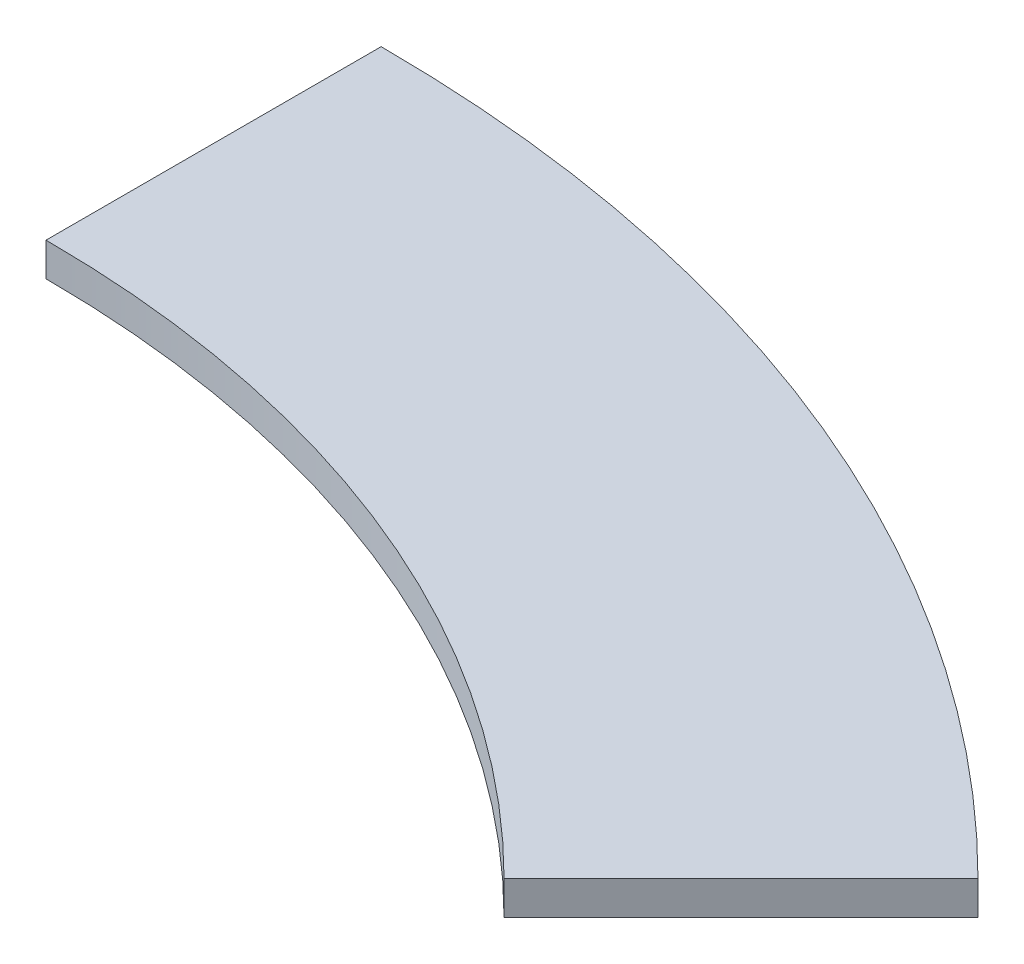
ISO-10303-21;
HEADER;
FILE_DESCRIPTION(('STEP AP214'),'2;1');
FILE_NAME('part.step','',(''),(''),'','','');
FILE_SCHEMA(('AUTOMOTIVE_DESIGN { 1 0 10303 214 1 1 1 1 }'));
ENDSEC;
DATA;
#1=APPLICATION_CONTEXT('core data for automotive mechanical design processes');
#2=APPLICATION_PROTOCOL_DEFINITION('international standard','automotive_design',2000,#1);
#3=PRODUCT_CONTEXT('',#1,'mechanical');
#4=PRODUCT('Part','Part','',(#3));
#5=PRODUCT_RELATED_PRODUCT_CATEGORY('part','',(#4));
#6=PRODUCT_DEFINITION_FORMATION('','',#4);
#7=PRODUCT_DEFINITION_CONTEXT('part definition',#1,'design');
#8=PRODUCT_DEFINITION('design','',#6,#7);
#9=PRODUCT_DEFINITION_SHAPE('','',#8);
#10=(LENGTH_UNIT() NAMED_UNIT(*) SI_UNIT(.MILLI.,.METRE.));
#11=(NAMED_UNIT(*) PLANE_ANGLE_UNIT() SI_UNIT($,.RADIAN.));
#12=(NAMED_UNIT(*) SI_UNIT($,.STERADIAN.) SOLID_ANGLE_UNIT());
#13=UNCERTAINTY_MEASURE_WITH_UNIT(LENGTH_MEASURE(1.E-05),#10,'distance_accuracy_value','');
#14=(GEOMETRIC_REPRESENTATION_CONTEXT(3) GLOBAL_UNCERTAINTY_ASSIGNED_CONTEXT((#13)) GLOBAL_UNIT_ASSIGNED_CONTEXT((#10,
#11,#12)) REPRESENTATION_CONTEXT('',''));
#15=CARTESIAN_POINT('',(0.,0.,0.));
#16=DIRECTION('',(0.,0.,1.));
#17=DIRECTION('',(1.,0.,0.));
#18=AXIS2_PLACEMENT_3D('',#15,#16,#17);
#19=CARTESIAN_POINT('',(0.,10.,0.));
#20=DIRECTION('',(0.,-1.,0.));
#21=DIRECTION('',(0.,0.,-1.));
#22=AXIS2_PLACEMENT_3D('',#19,#20,#21);
#23=CYLINDRICAL_SURFACE('',#22,430.);
#24=CARTESIAN_POINT('',(0.,0.,0.));
#25=DIRECTION('',(0.,1.,0.));
#26=DIRECTION('',(0.,0.,1.));
#27=AXIS2_PLACEMENT_3D('',#24,#25,#26);
#28=CIRCLE('',#27,430.);
#29=CARTESIAN_POINT('',(0.,0.,-430.));
#30=VERTEX_POINT('',#29);
#31=CARTESIAN_POINT('',(304.055915910216,0.,-304.055915910215));
#32=VERTEX_POINT('',#31);
#33=EDGE_CURVE('E99',#30,#32,#28,.F.);
#34=ORIENTED_EDGE('',*,*,#33,.F.);
#35=DIRECTION('',(0.,-1.,0.));
#36=VECTOR('',#35,1.);
#37=CARTESIAN_POINT('',(0.,10.,-430.));
#38=LINE('',#37,#36);
#39=CARTESIAN_POINT('',(0.,10.,-430.));
#40=VERTEX_POINT('',#39);
#41=EDGE_CURVE('E11',#40,#30,#38,.T.);
#42=ORIENTED_EDGE('',*,*,#41,.F.);
#43=CARTESIAN_POINT('',(0.,10.,0.));
#44=DIRECTION('',(0.,1.,0.));
#45=DIRECTION('',(0.,0.,1.));
#46=AXIS2_PLACEMENT_3D('',#43,#44,#45);
#47=CIRCLE('',#46,430.);
#48=CARTESIAN_POINT('',(304.055915910216,10.,-304.055915910215));
#49=VERTEX_POINT('',#48);
#50=EDGE_CURVE('E93',#40,#49,#47,.F.);
#51=ORIENTED_EDGE('',*,*,#50,.T.);
#52=DIRECTION('',(0.,-1.,0.));
#53=VECTOR('',#52,1.);
#54=CARTESIAN_POINT('',(304.055915910216,10.,-304.055915910215));
#55=LINE('',#54,#53);
#56=EDGE_CURVE('E74',#49,#32,#55,.T.);
#57=ORIENTED_EDGE('',*,*,#56,.T.);
#58=EDGE_LOOP('',(#34,#42,#51,#57));
#59=FACE_BOUND('',#58,.T.);
#60=ADVANCED_FACE('F36',(#59),#23,.T.);
#61=CARTESIAN_POINT('',(0.,10.,0.));
#62=DIRECTION('',(-1.,0.,0.));
#63=DIRECTION('',(0.,0.,1.));
#64=AXIS2_PLACEMENT_3D('',#61,#62,#63);
#65=PLANE('',#64);
#66=DIRECTION('',(0.,0.,-1.));
#67=VECTOR('',#66,1.);
#68=CARTESIAN_POINT('',(0.,0.,0.));
#69=LINE('',#68,#67);
#70=CARTESIAN_POINT('',(0.,0.,-330.));
#71=VERTEX_POINT('',#70);
#72=EDGE_CURVE('E87',#71,#30,#69,.T.);
#73=ORIENTED_EDGE('',*,*,#72,.F.);
#74=DIRECTION('',(0.,-1.,0.));
#75=VECTOR('',#74,1.);
#76=CARTESIAN_POINT('',(0.,10.,-330.));
#77=LINE('',#76,#75);
#78=CARTESIAN_POINT('',(0.,10.,-330.));
#79=VERTEX_POINT('',#78);
#80=EDGE_CURVE('E44',#79,#71,#77,.T.);
#81=ORIENTED_EDGE('',*,*,#80,.F.);
#82=DIRECTION('',(0.,0.,-1.));
#83=VECTOR('',#82,1.);
#84=CARTESIAN_POINT('',(0.,10.,0.));
#85=LINE('',#84,#83);
#86=EDGE_CURVE('E85',#79,#40,#85,.T.);
#87=ORIENTED_EDGE('',*,*,#86,.T.);
#88=ORIENTED_EDGE('',*,*,#41,.T.);
#89=EDGE_LOOP('',(#73,#81,#87,#88));
#90=FACE_BOUND('',#89,.T.);
#91=ADVANCED_FACE('F83',(#90),#65,.T.);
#92=CARTESIAN_POINT('',(0.,10.,0.));
#93=DIRECTION('',(0.,-1.,0.));
#94=DIRECTION('',(0.,0.,-1.));
#95=AXIS2_PLACEMENT_3D('',#92,#93,#94);
#96=CYLINDRICAL_SURFACE('',#95,330.);
#97=CARTESIAN_POINT('',(0.,0.,0.));
#98=DIRECTION('',(0.,1.,0.));
#99=DIRECTION('',(0.,0.,1.));
#100=AXIS2_PLACEMENT_3D('',#97,#98,#99);
#101=CIRCLE('',#100,330.);
#102=CARTESIAN_POINT('',(233.345237791561,0.,-233.34523779156));
#103=VERTEX_POINT('',#102);
#104=EDGE_CURVE('E67',#71,#103,#101,.F.);
#105=ORIENTED_EDGE('',*,*,#104,.T.);
#106=DIRECTION('',(0.,-1.,0.));
#107=VECTOR('',#106,1.);
#108=CARTESIAN_POINT('',(233.345237791561,10.,-233.34523779156));
#109=LINE('',#108,#107);
#110=CARTESIAN_POINT('',(233.345237791561,10.,-233.34523779156));
#111=VERTEX_POINT('',#110);
#112=EDGE_CURVE('E88',#111,#103,#109,.T.);
#113=ORIENTED_EDGE('',*,*,#112,.F.);
#114=CARTESIAN_POINT('',(0.,10.,0.));
#115=DIRECTION('',(0.,1.,0.));
#116=DIRECTION('',(0.,0.,1.));
#117=AXIS2_PLACEMENT_3D('',#114,#115,#116);
#118=CIRCLE('',#117,330.);
#119=EDGE_CURVE('E89',#79,#111,#118,.F.);
#120=ORIENTED_EDGE('',*,*,#119,.F.);
#121=ORIENTED_EDGE('',*,*,#80,.T.);
#122=EDGE_LOOP('',(#105,#113,#120,#121));
#123=FACE_BOUND('',#122,.T.);
#124=ADVANCED_FACE('F90',(#123),#96,.F.);
#125=CARTESIAN_POINT('',(0.,10.,0.));
#126=DIRECTION('',(-0.707106781186547,0.,-0.707106781186549));
#127=DIRECTION('',(-0.707106781186549,0.,0.707106781186547));
#128=AXIS2_PLACEMENT_3D('',#125,#126,#127);
#129=PLANE('',#128);
#130=DIRECTION('',(0.707106781186549,0.,-0.707106781186547));
#131=VECTOR('',#130,1.);
#132=CARTESIAN_POINT('',(0.,0.,0.));
#133=LINE('',#132,#131);
#134=EDGE_CURVE('E95',#103,#32,#133,.T.);
#135=ORIENTED_EDGE('',*,*,#134,.T.);
#136=ORIENTED_EDGE('',*,*,#56,.F.);
#137=DIRECTION('',(0.707106781186549,0.,-0.707106781186547));
#138=VECTOR('',#137,1.);
#139=CARTESIAN_POINT('',(0.,10.,0.));
#140=LINE('',#139,#138);
#141=EDGE_CURVE('E52',#111,#49,#140,.T.);
#142=ORIENTED_EDGE('',*,*,#141,.F.);
#143=ORIENTED_EDGE('',*,*,#112,.T.);
#144=EDGE_LOOP('',(#135,#136,#142,#143));
#145=FACE_BOUND('',#144,.T.);
#146=ADVANCED_FACE('F108',(#145),#129,.F.);
#147=CARTESIAN_POINT('',(0.,10.,0.));
#148=DIRECTION('',(0.,1.,0.));
#149=DIRECTION('',(0.,0.,1.));
#150=AXIS2_PLACEMENT_3D('',#147,#148,#149);
#151=PLANE('',#150);
#152=ORIENTED_EDGE('',*,*,#50,.F.);
#153=ORIENTED_EDGE('',*,*,#86,.F.);
#154=ORIENTED_EDGE('',*,*,#119,.T.);
#155=ORIENTED_EDGE('',*,*,#141,.T.);
#156=EDGE_LOOP('',(#152,#153,#154,#155));
#157=FACE_BOUND('',#156,.T.);
#158=ADVANCED_FACE('F92',(#157),#151,.T.);
#159=CARTESIAN_POINT('',(0.,0.,0.));
#160=DIRECTION('',(0.,1.,0.));
#161=DIRECTION('',(0.,0.,1.));
#162=AXIS2_PLACEMENT_3D('',#159,#160,#161);
#163=PLANE('',#162);
#164=ORIENTED_EDGE('',*,*,#33,.T.);
#165=ORIENTED_EDGE('',*,*,#134,.F.);
#166=ORIENTED_EDGE('',*,*,#104,.F.);
#167=ORIENTED_EDGE('',*,*,#72,.T.);
#168=EDGE_LOOP('',(#164,#165,#166,#167));
#169=FACE_BOUND('',#168,.T.);
#170=ADVANCED_FACE('F110',(#169),#163,.F.);
#171=CLOSED_SHELL('',(#60,#91,#124,#146,#158,#170));
#172=MANIFOLD_SOLID_BREP('B2',#171);
#173=ADVANCED_BREP_SHAPE_REPRESENTATION('',(#18,#172),#14);
#174=SHAPE_DEFINITION_REPRESENTATION(#9,#173);
ENDSEC;
END-ISO-10303-21;
